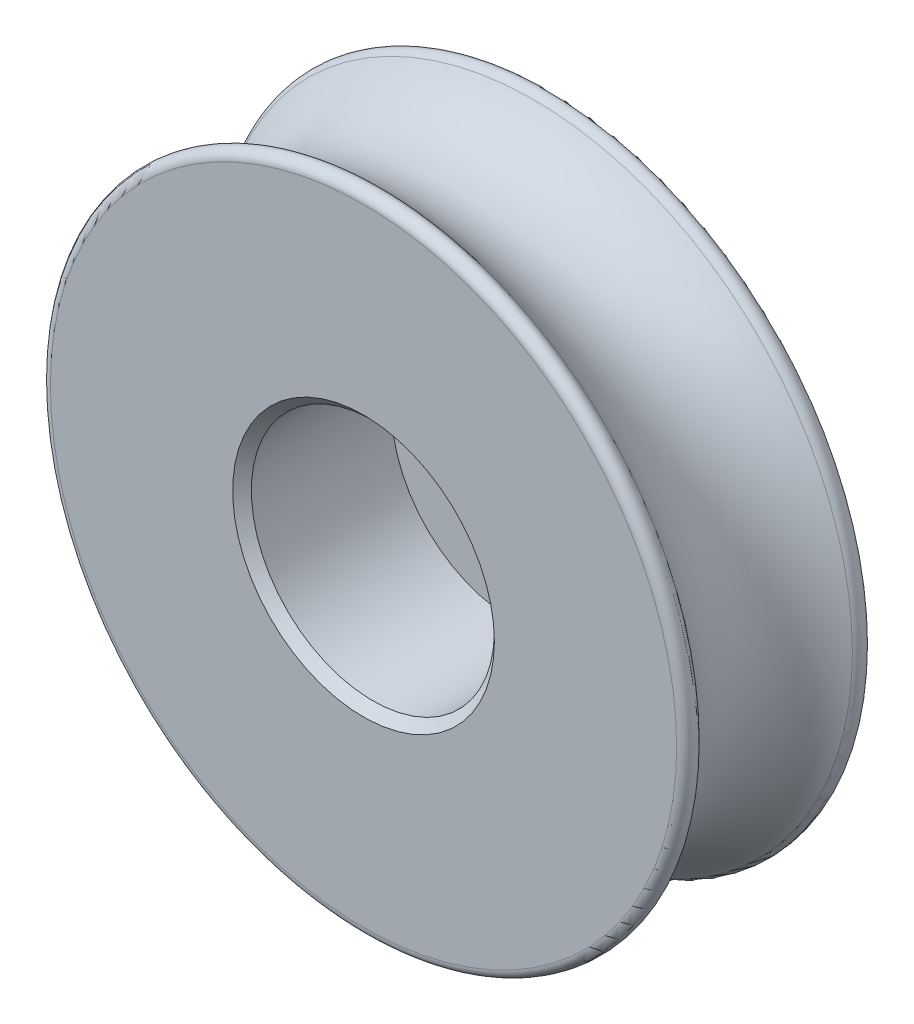
ISO-10303-21;
HEADER;
FILE_DESCRIPTION(('STEP AP214'),'2;1');
FILE_NAME('part.step','',(''),(''),'','','');
FILE_SCHEMA(('AUTOMOTIVE_DESIGN { 1 0 10303 214 1 1 1 1 }'));
ENDSEC;
DATA;
#1=APPLICATION_CONTEXT('core data for automotive mechanical design processes');
#2=APPLICATION_PROTOCOL_DEFINITION('international standard','automotive_design',2000,#1);
#3=PRODUCT_CONTEXT('',#1,'mechanical');
#4=PRODUCT('Part','Part','',(#3));
#5=PRODUCT_RELATED_PRODUCT_CATEGORY('part','',(#4));
#6=PRODUCT_DEFINITION_FORMATION('','',#4);
#7=PRODUCT_DEFINITION_CONTEXT('part definition',#1,'design');
#8=PRODUCT_DEFINITION('design','',#6,#7);
#9=PRODUCT_DEFINITION_SHAPE('','',#8);
#10=(LENGTH_UNIT() NAMED_UNIT(*) SI_UNIT(.MILLI.,.METRE.));
#11=(NAMED_UNIT(*) PLANE_ANGLE_UNIT() SI_UNIT($,.RADIAN.));
#12=(NAMED_UNIT(*) SI_UNIT($,.STERADIAN.) SOLID_ANGLE_UNIT());
#13=UNCERTAINTY_MEASURE_WITH_UNIT(LENGTH_MEASURE(1.E-05),#10,'distance_accuracy_value','');
#14=(GEOMETRIC_REPRESENTATION_CONTEXT(3) GLOBAL_UNCERTAINTY_ASSIGNED_CONTEXT((#13)) GLOBAL_UNIT_ASSIGNED_CONTEXT((#10,
#11,#12)) REPRESENTATION_CONTEXT('',''));
#15=CARTESIAN_POINT('',(0.,0.,0.));
#16=DIRECTION('',(0.,0.,1.));
#17=DIRECTION('',(1.,0.,0.));
#18=AXIS2_PLACEMENT_3D('',#15,#16,#17);
#19=CARTESIAN_POINT('',(0.,0.,-2.));
#20=DIRECTION('',(0.,0.,1.));
#21=DIRECTION('',(1.,0.,0.));
#22=AXIS2_PLACEMENT_3D('',#19,#20,#21);
#23=TOROIDAL_SURFACE('',#22,8.05,2.05);
#24=CARTESIAN_POINT('',(0.,0.,-3.64));
#25=DIRECTION('',(0.,0.,1.));
#26=DIRECTION('',(1.,0.,0.));
#27=AXIS2_PLACEMENT_3D('',#24,#25,#26);
#28=CIRCLE('',#27,6.82);
#29=CARTESIAN_POINT('',(6.82,0.,-3.64));
#30=VERTEX_POINT('',#29);
#31=EDGE_CURVE('E60',#30,#30,#28,.T.);
#32=ORIENTED_EDGE('',*,*,#31,.T.);
#33=EDGE_LOOP('',(#32));
#34=FACE_BOUND('',#33,.T.);
#35=CARTESIAN_POINT('',(0.,0.,-0.360000000000002));
#36=DIRECTION('',(0.,0.,-1.));
#37=DIRECTION('',(-1.,0.,0.));
#38=AXIS2_PLACEMENT_3D('',#35,#36,#37);
#39=CIRCLE('',#38,6.82);
#40=CARTESIAN_POINT('',(-6.82,0.,-0.360000000000002));
#41=VERTEX_POINT('',#40);
#42=EDGE_CURVE('E63',#41,#41,#39,.T.);
#43=ORIENTED_EDGE('',*,*,#42,.T.);
#44=EDGE_LOOP('',(#43));
#45=FACE_BOUND('',#44,.T.);
#46=ADVANCED_FACE('F33',(#34,#45),#23,.F.);
#47=CARTESIAN_POINT('',(1.1,0.,-4.));
#48=DIRECTION('',(0.,0.,-1.));
#49=DIRECTION('',(-1.,0.,0.));
#50=AXIS2_PLACEMENT_3D('',#47,#48,#49);
#51=PLANE('',#50);
#52=CARTESIAN_POINT('',(0.,0.,-4.));
#53=DIRECTION('',(0.,0.,-1.));
#54=DIRECTION('',(-1.,0.,0.));
#55=AXIS2_PLACEMENT_3D('',#52,#53,#54);
#56=CIRCLE('',#55,1.3);
#57=CARTESIAN_POINT('',(-1.3,0.,-4.));
#58=VERTEX_POINT('',#57);
#59=EDGE_CURVE('E49',#58,#58,#56,.F.);
#60=ORIENTED_EDGE('',*,*,#59,.T.);
#61=EDGE_LOOP('',(#60));
#62=FACE_BOUND('',#61,.T.);
#63=CARTESIAN_POINT('',(0.,0.,-4.));
#64=DIRECTION('',(0.,0.,-1.));
#65=DIRECTION('',(-1.,0.,0.));
#66=AXIS2_PLACEMENT_3D('',#63,#64,#65);
#67=CIRCLE('',#66,6.7);
#68=CARTESIAN_POINT('',(-6.7,0.,-4.));
#69=VERTEX_POINT('',#68);
#70=EDGE_CURVE('E57',#69,#69,#67,.T.);
#71=ORIENTED_EDGE('',*,*,#70,.T.);
#72=EDGE_LOOP('',(#71));
#73=FACE_BOUND('',#72,.T.);
#74=ADVANCED_FACE('F89',(#62,#73),#51,.T.);
#75=CARTESIAN_POINT('',(0.,0.,0.));
#76=DIRECTION('',(0.,0.,1.));
#77=DIRECTION('',(1.,0.,0.));
#78=AXIS2_PLACEMENT_3D('',#75,#76,#77);
#79=CYLINDRICAL_SURFACE('',#78,1.1);
#80=CARTESIAN_POINT('',(0.,0.,-3.8));
#81=DIRECTION('',(0.,0.,-1.));
#82=DIRECTION('',(-1.,0.,0.));
#83=AXIS2_PLACEMENT_3D('',#80,#81,#82);
#84=CIRCLE('',#83,1.1);
#85=CARTESIAN_POINT('',(-1.1,0.,-3.8));
#86=VERTEX_POINT('',#85);
#87=EDGE_CURVE('E45',#86,#86,#84,.T.);
#88=ORIENTED_EDGE('',*,*,#87,.T.);
#89=EDGE_LOOP('',(#88));
#90=FACE_BOUND('',#89,.T.);
#91=CARTESIAN_POINT('',(0.,0.,-3.2));
#92=DIRECTION('',(0.,0.,1.));
#93=DIRECTION('',(1.,0.,0.));
#94=AXIS2_PLACEMENT_3D('',#91,#92,#93);
#95=CIRCLE('',#94,1.1);
#96=CARTESIAN_POINT('',(1.1,0.,-3.2));
#97=VERTEX_POINT('',#96);
#98=EDGE_CURVE('E66',#97,#97,#95,.T.);
#99=ORIENTED_EDGE('',*,*,#98,.T.);
#100=EDGE_LOOP('',(#99));
#101=FACE_BOUND('',#100,.T.);
#102=ADVANCED_FACE('F86',(#90,#101),#79,.F.);
#103=CARTESIAN_POINT('',(2.6,0.,-3.2));
#104=DIRECTION('',(0.,0.,1.));
#105=DIRECTION('',(1.,0.,0.));
#106=AXIS2_PLACEMENT_3D('',#103,#104,#105);
#107=PLANE('',#106);
#108=CARTESIAN_POINT('',(0.,0.,-3.2));
#109=DIRECTION('',(0.,0.,1.));
#110=DIRECTION('',(1.,0.,0.));
#111=AXIS2_PLACEMENT_3D('',#108,#109,#110);
#112=CIRCLE('',#111,2.6);
#113=CARTESIAN_POINT('',(2.6,0.,-3.2));
#114=VERTEX_POINT('',#113);
#115=EDGE_CURVE('E69',#114,#114,#112,.T.);
#116=ORIENTED_EDGE('',*,*,#115,.T.);
#117=EDGE_LOOP('',(#116));
#118=FACE_BOUND('',#117,.T.);
#119=ORIENTED_EDGE('',*,*,#98,.F.);
#120=EDGE_LOOP('',(#119));
#121=FACE_BOUND('',#120,.T.);
#122=ADVANCED_FACE('F73',(#118,#121),#107,.T.);
#123=CARTESIAN_POINT('',(0.,0.,0.));
#124=DIRECTION('',(0.,0.,1.));
#125=DIRECTION('',(1.,0.,0.));
#126=AXIS2_PLACEMENT_3D('',#123,#124,#125);
#127=CYLINDRICAL_SURFACE('',#126,2.6);
#128=CARTESIAN_POINT('',(0.,0.,-0.200000000000001));
#129=DIRECTION('',(0.,0.,1.));
#130=DIRECTION('',(1.,0.,0.));
#131=AXIS2_PLACEMENT_3D('',#128,#129,#130);
#132=CIRCLE('',#131,2.6);
#133=CARTESIAN_POINT('',(2.6,0.,-0.200000000000001));
#134=VERTEX_POINT('',#133);
#135=EDGE_CURVE('E41',#134,#134,#132,.T.);
#136=ORIENTED_EDGE('',*,*,#135,.T.);
#137=EDGE_LOOP('',(#136));
#138=FACE_BOUND('',#137,.T.);
#139=ORIENTED_EDGE('',*,*,#115,.F.);
#140=EDGE_LOOP('',(#139));
#141=FACE_BOUND('',#140,.T.);
#142=ADVANCED_FACE('F76',(#138,#141),#127,.F.);
#143=CARTESIAN_POINT('',(7.6,0.,0.));
#144=DIRECTION('',(0.,0.,1.));
#145=DIRECTION('',(1.,0.,0.));
#146=AXIS2_PLACEMENT_3D('',#143,#144,#145);
#147=PLANE('',#146);
#148=CARTESIAN_POINT('',(0.,0.,0.));
#149=DIRECTION('',(0.,0.,1.));
#150=DIRECTION('',(1.,0.,0.));
#151=AXIS2_PLACEMENT_3D('',#148,#149,#150);
#152=CIRCLE('',#151,2.8);
#153=CARTESIAN_POINT('',(2.8,0.,0.));
#154=VERTEX_POINT('',#153);
#155=EDGE_CURVE('E10',#154,#154,#152,.F.);
#156=ORIENTED_EDGE('',*,*,#155,.T.);
#157=EDGE_LOOP('',(#156));
#158=FACE_BOUND('',#157,.T.);
#159=CARTESIAN_POINT('',(0.,0.,0.));
#160=DIRECTION('',(0.,0.,1.));
#161=DIRECTION('',(1.,0.,0.));
#162=AXIS2_PLACEMENT_3D('',#159,#160,#161);
#163=CIRCLE('',#162,6.7);
#164=CARTESIAN_POINT('',(6.7,0.,0.));
#165=VERTEX_POINT('',#164);
#166=EDGE_CURVE('E54',#165,#165,#163,.T.);
#167=ORIENTED_EDGE('',*,*,#166,.T.);
#168=EDGE_LOOP('',(#167));
#169=FACE_BOUND('',#168,.T.);
#170=ADVANCED_FACE('F78',(#158,#169),#147,.T.);
#171=CARTESIAN_POINT('',(0.,0.,-3.8));
#172=DIRECTION('',(0.,0.,1.));
#173=DIRECTION('',(1.,0.,0.));
#174=AXIS2_PLACEMENT_3D('',#171,#172,#173);
#175=TOROIDAL_SURFACE('',#174,6.7,0.2);
#176=ORIENTED_EDGE('',*,*,#70,.F.);
#177=EDGE_LOOP('',(#176));
#178=FACE_BOUND('',#177,.T.);
#179=ORIENTED_EDGE('',*,*,#31,.F.);
#180=EDGE_LOOP('',(#179));
#181=FACE_BOUND('',#180,.T.);
#182=ADVANCED_FACE('F84',(#178,#181),#175,.T.);
#183=CARTESIAN_POINT('',(0.,0.,-0.2));
#184=DIRECTION('',(0.,0.,-1.));
#185=DIRECTION('',(-1.,0.,0.));
#186=AXIS2_PLACEMENT_3D('',#183,#184,#185);
#187=TOROIDAL_SURFACE('',#186,6.7,0.2);
#188=ORIENTED_EDGE('',*,*,#42,.F.);
#189=EDGE_LOOP('',(#188));
#190=FACE_BOUND('',#189,.T.);
#191=ORIENTED_EDGE('',*,*,#166,.F.);
#192=EDGE_LOOP('',(#191));
#193=FACE_BOUND('',#192,.T.);
#194=ADVANCED_FACE('F102',(#190,#193),#187,.T.);
#195=CARTESIAN_POINT('',(0.,0.,-4.));
#196=DIRECTION('',(0.,0.,-1.));
#197=DIRECTION('',(-1.,0.,0.));
#198=AXIS2_PLACEMENT_3D('',#195,#196,#197);
#199=CONICAL_SURFACE('',#198,1.3,0.785398163397449);
#200=ORIENTED_EDGE('',*,*,#87,.F.);
#201=EDGE_LOOP('',(#200));
#202=FACE_BOUND('',#201,.T.);
#203=ORIENTED_EDGE('',*,*,#59,.F.);
#204=EDGE_LOOP('',(#203));
#205=FACE_BOUND('',#204,.T.);
#206=ADVANCED_FACE('F105',(#202,#205),#199,.F.);
#207=CARTESIAN_POINT('',(0.,0.,-0.200000000000001));
#208=DIRECTION('',(0.,0.,1.));
#209=DIRECTION('',(1.,0.,0.));
#210=AXIS2_PLACEMENT_3D('',#207,#208,#209);
#211=CONICAL_SURFACE('',#210,2.6,0.785398163397451);
#212=ORIENTED_EDGE('',*,*,#155,.F.);
#213=EDGE_LOOP('',(#212));
#214=FACE_BOUND('',#213,.T.);
#215=ORIENTED_EDGE('',*,*,#135,.F.);
#216=EDGE_LOOP('',(#215));
#217=FACE_BOUND('',#216,.T.);
#218=ADVANCED_FACE('F36',(#214,#217),#211,.F.);
#219=CLOSED_SHELL('',(#46,#74,#102,#122,#142,#170,#182,#194,#206,#218));
#220=MANIFOLD_SOLID_BREP('B2',#219);
#221=ADVANCED_BREP_SHAPE_REPRESENTATION('',(#18,#220),#14);
#222=SHAPE_DEFINITION_REPRESENTATION(#9,#221);
ENDSEC;
END-ISO-10303-21;
